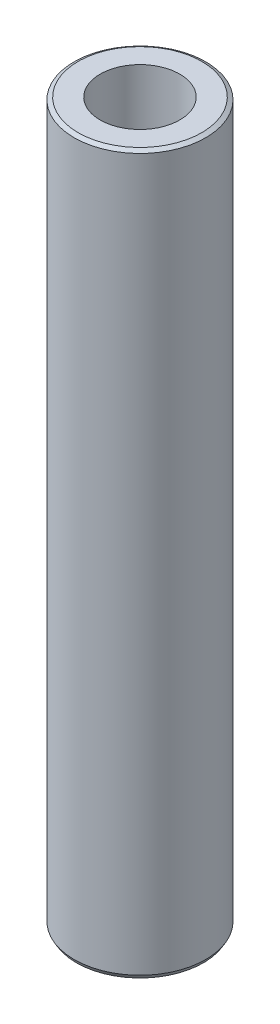
ISO-10303-21;
HEADER;
FILE_DESCRIPTION(('STEP AP214'),'2;1');
FILE_NAME('part.step','',(''),(''),'','','');
FILE_SCHEMA(('AUTOMOTIVE_DESIGN { 1 0 10303 214 1 1 1 1 }'));
ENDSEC;
DATA;
#1=APPLICATION_CONTEXT('core data for automotive mechanical design processes');
#2=APPLICATION_PROTOCOL_DEFINITION('international standard','automotive_design',2000,#1);
#3=PRODUCT_CONTEXT('',#1,'mechanical');
#4=PRODUCT('Part','Part','',(#3));
#5=PRODUCT_RELATED_PRODUCT_CATEGORY('part','',(#4));
#6=PRODUCT_DEFINITION_FORMATION('','',#4);
#7=PRODUCT_DEFINITION_CONTEXT('part definition',#1,'design');
#8=PRODUCT_DEFINITION('design','',#6,#7);
#9=PRODUCT_DEFINITION_SHAPE('','',#8);
#10=(LENGTH_UNIT() NAMED_UNIT(*) SI_UNIT(.MILLI.,.METRE.));
#11=(NAMED_UNIT(*) PLANE_ANGLE_UNIT() SI_UNIT($,.RADIAN.));
#12=(NAMED_UNIT(*) SI_UNIT($,.STERADIAN.) SOLID_ANGLE_UNIT());
#13=UNCERTAINTY_MEASURE_WITH_UNIT(LENGTH_MEASURE(1.E-05),#10,'distance_accuracy_value','');
#14=(GEOMETRIC_REPRESENTATION_CONTEXT(3) GLOBAL_UNCERTAINTY_ASSIGNED_CONTEXT((#13)) GLOBAL_UNIT_ASSIGNED_CONTEXT((#10,
#11,#12)) REPRESENTATION_CONTEXT('',''));
#15=CARTESIAN_POINT('',(0.,0.,0.));
#16=DIRECTION('',(0.,0.,1.));
#17=DIRECTION('',(1.,0.,0.));
#18=AXIS2_PLACEMENT_3D('',#15,#16,#17);
#19=CARTESIAN_POINT('',(0.,600.,0.));
#20=DIRECTION('',(0.,-1.,0.));
#21=DIRECTION('',(0.,0.,-1.));
#22=AXIS2_PLACEMENT_3D('',#19,#20,#21);
#23=CYLINDRICAL_SURFACE('',#22,55.);
#24=CARTESIAN_POINT('',(0.,598.047854144863,0.));
#25=DIRECTION('',(0.,1.,0.));
#26=DIRECTION('',(0.,0.,1.));
#27=AXIS2_PLACEMENT_3D('',#24,#25,#26);
#28=CIRCLE('',#27,55.);
#29=CARTESIAN_POINT('',(0.,598.047854144863,55.));
#30=VERTEX_POINT('',#29);
#31=EDGE_CURVE('E50',#30,#30,#28,.F.);
#32=ORIENTED_EDGE('',*,*,#31,.T.);
#33=EDGE_LOOP('',(#32));
#34=FACE_BOUND('',#33,.T.);
#35=CARTESIAN_POINT('',(0.,3.38121580488204,0.));
#36=DIRECTION('',(0.,1.,0.));
#37=DIRECTION('',(0.,0.,1.));
#38=AXIS2_PLACEMENT_3D('',#35,#36,#37);
#39=CIRCLE('',#38,55.);
#40=CARTESIAN_POINT('',(0.,3.38121580488204,55.));
#41=VERTEX_POINT('',#40);
#42=EDGE_CURVE('E51',#41,#41,#39,.T.);
#43=ORIENTED_EDGE('',*,*,#42,.T.);
#44=EDGE_LOOP('',(#43));
#45=FACE_BOUND('',#44,.T.);
#46=ADVANCED_FACE('F39',(#34,#45),#23,.T.);
#47=CARTESIAN_POINT('',(0.,600.,0.));
#48=DIRECTION('',(0.,1.,0.));
#49=DIRECTION('',(0.,0.,1.));
#50=AXIS2_PLACEMENT_3D('',#47,#48,#49);
#51=PLANE('',#50);
#52=CARTESIAN_POINT('',(0.,600.,0.));
#53=DIRECTION('',(0.,1.,0.));
#54=DIRECTION('',(0.,0.,1.));
#55=AXIS2_PLACEMENT_3D('',#52,#53,#54);
#56=CIRCLE('',#55,51.6187841951178);
#57=CARTESIAN_POINT('',(0.,600.,51.6187841951178));
#58=VERTEX_POINT('',#57);
#59=EDGE_CURVE('E54',#58,#58,#56,.T.);
#60=ORIENTED_EDGE('',*,*,#59,.T.);
#61=EDGE_LOOP('',(#60));
#62=FACE_BOUND('',#61,.T.);
#63=CARTESIAN_POINT('',(0.,600.,0.));
#64=DIRECTION('',(0.,1.,0.));
#65=DIRECTION('',(0.,0.,1.));
#66=AXIS2_PLACEMENT_3D('',#63,#64,#65);
#67=CIRCLE('',#66,33.2493639768031);
#68=CARTESIAN_POINT('',(0.,600.,33.2493639768031));
#69=VERTEX_POINT('',#68);
#70=EDGE_CURVE('E58',#69,#69,#67,.T.);
#71=ORIENTED_EDGE('',*,*,#70,.F.);
#72=EDGE_LOOP('',(#71));
#73=FACE_BOUND('',#72,.T.);
#74=ADVANCED_FACE('F69',(#62,#73),#51,.T.);
#75=CARTESIAN_POINT('',(0.,0.,0.));
#76=DIRECTION('',(0.,1.,0.));
#77=DIRECTION('',(0.,0.,1.));
#78=AXIS2_PLACEMENT_3D('',#75,#76,#77);
#79=PLANE('',#78);
#80=CARTESIAN_POINT('',(0.,0.,0.));
#81=DIRECTION('',(0.,1.,0.));
#82=DIRECTION('',(0.,0.,1.));
#83=AXIS2_PLACEMENT_3D('',#80,#81,#82);
#84=CIRCLE('',#83,53.0478541448631);
#85=CARTESIAN_POINT('',(0.,0.,53.0478541448631));
#86=VERTEX_POINT('',#85);
#87=EDGE_CURVE('E10',#86,#86,#84,.F.);
#88=ORIENTED_EDGE('',*,*,#87,.T.);
#89=EDGE_LOOP('',(#88));
#90=FACE_BOUND('',#89,.T.);
#91=CARTESIAN_POINT('',(0.,0.,0.));
#92=DIRECTION('',(0.,1.,0.));
#93=DIRECTION('',(0.,0.,1.));
#94=AXIS2_PLACEMENT_3D('',#91,#92,#93);
#95=CIRCLE('',#94,33.2493639768031);
#96=CARTESIAN_POINT('',(0.,0.,33.2493639768031));
#97=VERTEX_POINT('',#96);
#98=EDGE_CURVE('E63',#97,#97,#95,.T.);
#99=ORIENTED_EDGE('',*,*,#98,.T.);
#100=EDGE_LOOP('',(#99));
#101=FACE_BOUND('',#100,.T.);
#102=ADVANCED_FACE('F75',(#90,#101),#79,.F.);
#103=CARTESIAN_POINT('',(0.,600.,0.));
#104=DIRECTION('',(0.,-1.,0.));
#105=DIRECTION('',(0.,0.,-1.));
#106=AXIS2_PLACEMENT_3D('',#103,#104,#105);
#107=CYLINDRICAL_SURFACE('',#106,33.2493639768031);
#108=ORIENTED_EDGE('',*,*,#70,.T.);
#109=EDGE_LOOP('',(#108));
#110=FACE_BOUND('',#109,.T.);
#111=ORIENTED_EDGE('',*,*,#98,.F.);
#112=EDGE_LOOP('',(#111));
#113=FACE_BOUND('',#112,.T.);
#114=ADVANCED_FACE('F70',(#110,#113),#107,.F.);
#115=CARTESIAN_POINT('',(0.,600.,0.));
#116=DIRECTION('',(0.,-1.,0.));
#117=DIRECTION('',(0.,0.,-1.));
#118=AXIS2_PLACEMENT_3D('',#115,#116,#117);
#119=CONICAL_SURFACE('',#118,51.6187841951178,1.04719755119661);
#120=ORIENTED_EDGE('',*,*,#31,.F.);
#121=EDGE_LOOP('',(#120));
#122=FACE_BOUND('',#121,.T.);
#123=ORIENTED_EDGE('',*,*,#59,.F.);
#124=EDGE_LOOP('',(#123));
#125=FACE_BOUND('',#124,.T.);
#126=ADVANCED_FACE('F81',(#122,#125),#119,.T.);
#127=CARTESIAN_POINT('',(0.,3.38121580488204,0.));
#128=DIRECTION('',(0.,1.,0.));
#129=DIRECTION('',(0.,0.,1.));
#130=AXIS2_PLACEMENT_3D('',#127,#128,#129);
#131=CONICAL_SURFACE('',#130,55.,0.523598775598313);
#132=ORIENTED_EDGE('',*,*,#87,.F.);
#133=EDGE_LOOP('',(#132));
#134=FACE_BOUND('',#133,.T.);
#135=ORIENTED_EDGE('',*,*,#42,.F.);
#136=EDGE_LOOP('',(#135));
#137=FACE_BOUND('',#136,.T.);
#138=ADVANCED_FACE('F45',(#134,#137),#131,.T.);
#139=CLOSED_SHELL('',(#46,#74,#102,#114,#126,#138));
#140=MANIFOLD_SOLID_BREP('B2',#139);
#141=ADVANCED_BREP_SHAPE_REPRESENTATION('',(#18,#140),#14);
#142=SHAPE_DEFINITION_REPRESENTATION(#9,#141);
ENDSEC;
END-ISO-10303-21;
